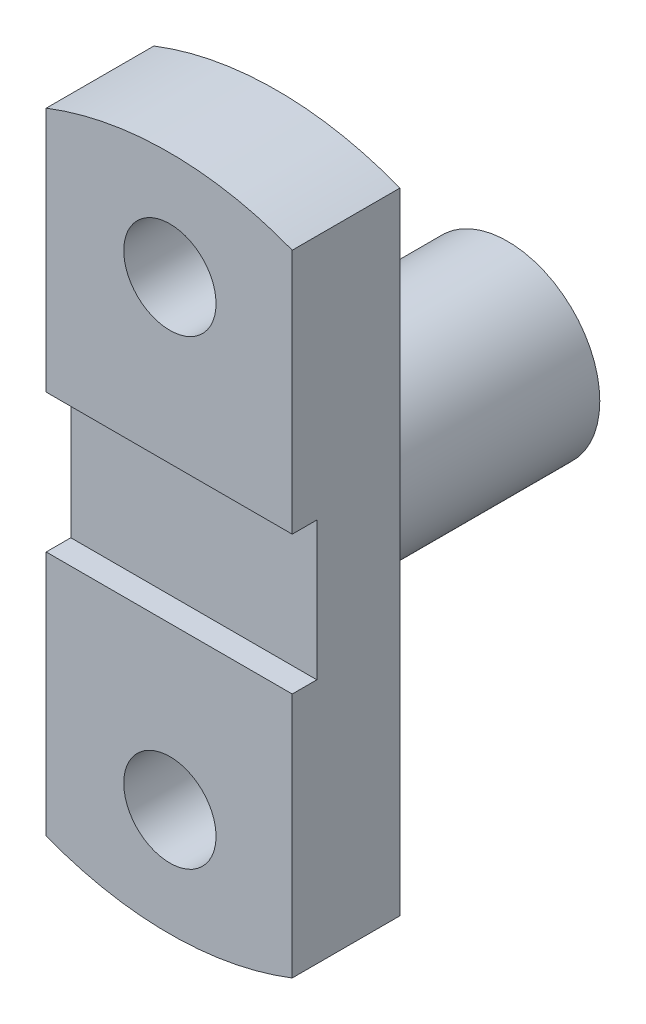
ISO-10303-21;
HEADER;
FILE_DESCRIPTION(('STEP AP214'),'2;1');
FILE_NAME('part.step','',(''),(''),'','','');
FILE_SCHEMA(('AUTOMOTIVE_DESIGN { 1 0 10303 214 1 1 1 1 }'));
ENDSEC;
DATA;
#1=APPLICATION_CONTEXT('core data for automotive mechanical design processes');
#2=APPLICATION_PROTOCOL_DEFINITION('international standard','automotive_design',2000,#1);
#3=PRODUCT_CONTEXT('',#1,'mechanical');
#4=PRODUCT('Part','Part','',(#3));
#5=PRODUCT_RELATED_PRODUCT_CATEGORY('part','',(#4));
#6=PRODUCT_DEFINITION_FORMATION('','',#4);
#7=PRODUCT_DEFINITION_CONTEXT('part definition',#1,'design');
#8=PRODUCT_DEFINITION('design','',#6,#7);
#9=PRODUCT_DEFINITION_SHAPE('','',#8);
#10=(LENGTH_UNIT() NAMED_UNIT(*) SI_UNIT(.MILLI.,.METRE.));
#11=(NAMED_UNIT(*) PLANE_ANGLE_UNIT() SI_UNIT($,.RADIAN.));
#12=(NAMED_UNIT(*) SI_UNIT($,.STERADIAN.) SOLID_ANGLE_UNIT());
#13=UNCERTAINTY_MEASURE_WITH_UNIT(LENGTH_MEASURE(1.E-05),#10,'distance_accuracy_value','');
#14=(GEOMETRIC_REPRESENTATION_CONTEXT(3) GLOBAL_UNCERTAINTY_ASSIGNED_CONTEXT((#13)) GLOBAL_UNIT_ASSIGNED_CONTEXT((#10,
#11,#12)) REPRESENTATION_CONTEXT('',''));
#15=CARTESIAN_POINT('',(0.,0.,0.));
#16=DIRECTION('',(0.,0.,1.));
#17=DIRECTION('',(1.,0.,0.));
#18=AXIS2_PLACEMENT_3D('',#15,#16,#17);
#19=CARTESIAN_POINT('',(0.,0.,35.));
#20=DIRECTION('',(0.,0.,1.));
#21=DIRECTION('',(1.,0.,0.));
#22=AXIS2_PLACEMENT_3D('',#19,#20,#21);
#23=PLANE('',#22);
#24=DIRECTION('',(1.,0.,0.));
#25=VECTOR('',#24,1.);
#26=CARTESIAN_POINT('',(-45.,22.5,35.));
#27=LINE('',#26,#25);
#28=CARTESIAN_POINT('',(-40.,22.5,35.));
#29=VERTEX_POINT('',#28);
#30=CARTESIAN_POINT('',(40.,22.5,35.));
#31=VERTEX_POINT('',#30);
#32=EDGE_CURVE('E153',#29,#31,#27,.T.);
#33=ORIENTED_EDGE('',*,*,#32,.T.);
#34=DIRECTION('',(0.,1.,0.));
#35=VECTOR('',#34,1.);
#36=CARTESIAN_POINT('',(40.,-102.469507659596,35.));
#37=LINE('',#36,#35);
#38=CARTESIAN_POINT('',(40.,102.469507659596,35.));
#39=VERTEX_POINT('',#38);
#40=EDGE_CURVE('E70',#31,#39,#37,.T.);
#41=ORIENTED_EDGE('',*,*,#40,.T.);
#42=CARTESIAN_POINT('',(0.,0.,35.));
#43=DIRECTION('',(0.,0.,1.));
#44=DIRECTION('',(1.,0.,0.));
#45=AXIS2_PLACEMENT_3D('',#42,#43,#44);
#46=CIRCLE('',#45,110.);
#47=CARTESIAN_POINT('',(-40.,102.469507659596,35.));
#48=VERTEX_POINT('',#47);
#49=EDGE_CURVE('E183',#39,#48,#46,.T.);
#50=ORIENTED_EDGE('',*,*,#49,.T.);
#51=DIRECTION('',(0.,-1.,0.));
#52=VECTOR('',#51,1.);
#53=CARTESIAN_POINT('',(-40.,-102.469507659596,35.));
#54=LINE('',#53,#52);
#55=EDGE_CURVE('E100',#48,#29,#54,.T.);
#56=ORIENTED_EDGE('',*,*,#55,.T.);
#57=EDGE_LOOP('',(#33,#41,#50,#56));
#58=FACE_BOUND('',#57,.T.);
#59=CARTESIAN_POINT('',(0.217775186598629,75.,35.));
#60=DIRECTION('',(0.,0.,1.));
#61=DIRECTION('',(1.,0.,0.));
#62=AXIS2_PLACEMENT_3D('',#59,#60,#61);
#63=CIRCLE('',#62,15.);
#64=CARTESIAN_POINT('',(15.2177751865986,75.,35.));
#65=VERTEX_POINT('',#64);
#66=EDGE_CURVE('E175',#65,#65,#63,.T.);
#67=ORIENTED_EDGE('',*,*,#66,.F.);
#68=EDGE_LOOP('',(#67));
#69=FACE_BOUND('',#68,.T.);
#70=ADVANCED_FACE('F45',(#58,#69),#23,.T.);
#71=DIRECTION('',(1.,0.,0.));
#72=VECTOR('',#71,1.);
#73=CARTESIAN_POINT('',(-45.,-22.5,35.));
#74=LINE('',#73,#72);
#75=CARTESIAN_POINT('',(-40.,-22.5,35.));
#76=VERTEX_POINT('',#75);
#77=CARTESIAN_POINT('',(40.,-22.5,35.));
#78=VERTEX_POINT('',#77);
#79=EDGE_CURVE('E61',#76,#78,#74,.T.);
#80=ORIENTED_EDGE('',*,*,#79,.F.);
#81=CARTESIAN_POINT('',(-40.,-102.469507659596,35.));
#82=VERTEX_POINT('',#81);
#83=EDGE_CURVE('E186',#76,#82,#54,.T.);
#84=ORIENTED_EDGE('',*,*,#83,.T.);
#85=CARTESIAN_POINT('',(0.,0.,35.));
#86=DIRECTION('',(0.,0.,1.));
#87=DIRECTION('',(1.,0.,0.));
#88=AXIS2_PLACEMENT_3D('',#85,#86,#87);
#89=CIRCLE('',#88,110.);
#90=CARTESIAN_POINT('',(40.,-102.469507659596,35.));
#91=VERTEX_POINT('',#90);
#92=EDGE_CURVE('E189',#82,#91,#89,.T.);
#93=ORIENTED_EDGE('',*,*,#92,.T.);
#94=EDGE_CURVE('E192',#91,#78,#37,.T.);
#95=ORIENTED_EDGE('',*,*,#94,.T.);
#96=EDGE_LOOP('',(#80,#84,#93,#95));
#97=FACE_BOUND('',#96,.T.);
#98=CARTESIAN_POINT('',(0.217775186598518,-75.,35.));
#99=DIRECTION('',(0.,0.,1.));
#100=DIRECTION('',(-1.,0.,0.));
#101=AXIS2_PLACEMENT_3D('',#98,#99,#100);
#102=CIRCLE('',#101,15.);
#103=CARTESIAN_POINT('',(-14.7822248134015,-75.,35.));
#104=VERTEX_POINT('',#103);
#105=EDGE_CURVE('E168',#104,#104,#102,.T.);
#106=ORIENTED_EDGE('',*,*,#105,.F.);
#107=EDGE_LOOP('',(#106));
#108=FACE_BOUND('',#107,.T.);
#109=ADVANCED_FACE('F231',(#97,#108),#23,.T.);
#110=CARTESIAN_POINT('',(0.,0.,0.));
#111=DIRECTION('',(0.,0.,1.));
#112=DIRECTION('',(1.,0.,0.));
#113=AXIS2_PLACEMENT_3D('',#110,#111,#112);
#114=PLANE('',#113);
#115=CARTESIAN_POINT('',(0.,0.,0.));
#116=DIRECTION('',(0.,0.,1.));
#117=DIRECTION('',(1.,0.,0.));
#118=AXIS2_PLACEMENT_3D('',#115,#116,#117);
#119=CIRCLE('',#118,30.);
#120=CARTESIAN_POINT('',(30.,0.,0.));
#121=VERTEX_POINT('',#120);
#122=EDGE_CURVE('E11',#121,#121,#119,.F.);
#123=ORIENTED_EDGE('',*,*,#122,.F.);
#124=EDGE_LOOP('',(#123));
#125=FACE_BOUND('',#124,.T.);
#126=CARTESIAN_POINT('',(0.,0.,0.));
#127=DIRECTION('',(0.,0.,1.));
#128=DIRECTION('',(1.,0.,0.));
#129=AXIS2_PLACEMENT_3D('',#126,#127,#128);
#130=CIRCLE('',#129,110.);
#131=CARTESIAN_POINT('',(40.,102.469507659596,0.));
#132=VERTEX_POINT('',#131);
#133=CARTESIAN_POINT('',(-40.,102.469507659596,0.));
#134=VERTEX_POINT('',#133);
#135=EDGE_CURVE('E179',#132,#134,#130,.T.);
#136=ORIENTED_EDGE('',*,*,#135,.F.);
#137=DIRECTION('',(0.,1.,0.));
#138=VECTOR('',#137,1.);
#139=CARTESIAN_POINT('',(40.,-102.469507659596,0.));
#140=LINE('',#139,#138);
#141=CARTESIAN_POINT('',(40.,-102.469507659596,0.));
#142=VERTEX_POINT('',#141);
#143=EDGE_CURVE('E92',#142,#132,#140,.T.);
#144=ORIENTED_EDGE('',*,*,#143,.F.);
#145=CARTESIAN_POINT('',(0.,0.,0.));
#146=DIRECTION('',(0.,0.,1.));
#147=DIRECTION('',(1.,0.,0.));
#148=AXIS2_PLACEMENT_3D('',#145,#146,#147);
#149=CIRCLE('',#148,110.);
#150=CARTESIAN_POINT('',(-40.,-102.469507659596,0.));
#151=VERTEX_POINT('',#150);
#152=EDGE_CURVE('E202',#151,#142,#149,.T.);
#153=ORIENTED_EDGE('',*,*,#152,.F.);
#154=DIRECTION('',(0.,-1.,0.));
#155=VECTOR('',#154,1.);
#156=CARTESIAN_POINT('',(-40.,-102.469507659596,0.));
#157=LINE('',#156,#155);
#158=EDGE_CURVE('E199',#134,#151,#157,.T.);
#159=ORIENTED_EDGE('',*,*,#158,.F.);
#160=EDGE_LOOP('',(#136,#144,#153,#159));
#161=FACE_BOUND('',#160,.T.);
#162=CARTESIAN_POINT('',(0.217775186598629,75.,0.));
#163=DIRECTION('',(0.,0.,1.));
#164=DIRECTION('',(1.,0.,0.));
#165=AXIS2_PLACEMENT_3D('',#162,#163,#164);
#166=CIRCLE('',#165,15.);
#167=CARTESIAN_POINT('',(15.2177751865986,75.,0.));
#168=VERTEX_POINT('',#167);
#169=EDGE_CURVE('E171',#168,#168,#166,.T.);
#170=ORIENTED_EDGE('',*,*,#169,.T.);
#171=EDGE_LOOP('',(#170));
#172=FACE_BOUND('',#171,.T.);
#173=CARTESIAN_POINT('',(0.217775186598518,-75.,0.));
#174=DIRECTION('',(0.,0.,1.));
#175=DIRECTION('',(-1.,0.,0.));
#176=AXIS2_PLACEMENT_3D('',#173,#174,#175);
#177=CIRCLE('',#176,15.);
#178=CARTESIAN_POINT('',(-14.7822248134015,-75.,0.));
#179=VERTEX_POINT('',#178);
#180=EDGE_CURVE('E167',#179,#179,#177,.T.);
#181=ORIENTED_EDGE('',*,*,#180,.T.);
#182=EDGE_LOOP('',(#181));
#183=FACE_BOUND('',#182,.T.);
#184=ADVANCED_FACE('F223',(#125,#161,#172,#183),#114,.F.);
#185=CARTESIAN_POINT('',(0.,0.,35.));
#186=DIRECTION('',(0.,0.,-1.));
#187=DIRECTION('',(-1.,0.,0.));
#188=AXIS2_PLACEMENT_3D('',#185,#186,#187);
#189=CYLINDRICAL_SURFACE('',#188,110.);
#190=ORIENTED_EDGE('',*,*,#135,.T.);
#191=DIRECTION('',(0.,0.,-1.));
#192=VECTOR('',#191,1.);
#193=CARTESIAN_POINT('',(-40.,102.469507659596,35.));
#194=LINE('',#193,#192);
#195=EDGE_CURVE('E54',#48,#134,#194,.T.);
#196=ORIENTED_EDGE('',*,*,#195,.F.);
#197=ORIENTED_EDGE('',*,*,#49,.F.);
#198=DIRECTION('',(0.,0.,-1.));
#199=VECTOR('',#198,1.);
#200=CARTESIAN_POINT('',(40.,102.469507659596,35.));
#201=LINE('',#200,#199);
#202=EDGE_CURVE('E195',#39,#132,#201,.T.);
#203=ORIENTED_EDGE('',*,*,#202,.T.);
#204=EDGE_LOOP('',(#190,#196,#197,#203));
#205=FACE_BOUND('',#204,.T.);
#206=ADVANCED_FACE('F47',(#205),#189,.T.);
#207=CARTESIAN_POINT('',(-40.,-102.469507659596,35.));
#208=DIRECTION('',(1.,0.,0.));
#209=DIRECTION('',(0.,0.,-1.));
#210=AXIS2_PLACEMENT_3D('',#207,#208,#209);
#211=PLANE('',#210);
#212=DIRECTION('',(0.,1.,0.));
#213=VECTOR('',#212,1.);
#214=CARTESIAN_POINT('',(-40.,-102.469507659596,27.));
#215=LINE('',#214,#213);
#216=CARTESIAN_POINT('',(-40.,-22.5,27.));
#217=VERTEX_POINT('',#216);
#218=CARTESIAN_POINT('',(-40.,22.5,27.));
#219=VERTEX_POINT('',#218);
#220=EDGE_CURVE('E131',#217,#219,#215,.T.);
#221=ORIENTED_EDGE('',*,*,#220,.T.);
#222=DIRECTION('',(0.,0.,1.));
#223=VECTOR('',#222,1.);
#224=CARTESIAN_POINT('',(-40.,22.5,35.));
#225=LINE('',#224,#223);
#226=EDGE_CURVE('E164',#219,#29,#225,.T.);
#227=ORIENTED_EDGE('',*,*,#226,.T.);
#228=ORIENTED_EDGE('',*,*,#55,.F.);
#229=ORIENTED_EDGE('',*,*,#195,.T.);
#230=ORIENTED_EDGE('',*,*,#158,.T.);
#231=DIRECTION('',(0.,0.,-1.));
#232=VECTOR('',#231,1.);
#233=CARTESIAN_POINT('',(-40.,-102.469507659596,35.));
#234=LINE('',#233,#232);
#235=EDGE_CURVE('E212',#82,#151,#234,.T.);
#236=ORIENTED_EDGE('',*,*,#235,.F.);
#237=ORIENTED_EDGE('',*,*,#83,.F.);
#238=DIRECTION('',(0.,0.,-1.));
#239=VECTOR('',#238,1.);
#240=CARTESIAN_POINT('',(-40.,-22.5,35.));
#241=LINE('',#240,#239);
#242=EDGE_CURVE('E156',#76,#217,#241,.T.);
#243=ORIENTED_EDGE('',*,*,#242,.T.);
#244=EDGE_LOOP('',(#221,#227,#228,#229,#230,#236,#237,#243));
#245=FACE_BOUND('',#244,.T.);
#246=ADVANCED_FACE('F217',(#245),#211,.F.);
#247=CARTESIAN_POINT('',(0.,0.,35.));
#248=DIRECTION('',(0.,0.,-1.));
#249=DIRECTION('',(-1.,0.,0.));
#250=AXIS2_PLACEMENT_3D('',#247,#248,#249);
#251=CYLINDRICAL_SURFACE('',#250,110.);
#252=ORIENTED_EDGE('',*,*,#152,.T.);
#253=DIRECTION('',(0.,0.,-1.));
#254=VECTOR('',#253,1.);
#255=CARTESIAN_POINT('',(40.,-102.469507659596,35.));
#256=LINE('',#255,#254);
#257=EDGE_CURVE('E209',#91,#142,#256,.T.);
#258=ORIENTED_EDGE('',*,*,#257,.F.);
#259=ORIENTED_EDGE('',*,*,#92,.F.);
#260=ORIENTED_EDGE('',*,*,#235,.T.);
#261=EDGE_LOOP('',(#252,#258,#259,#260));
#262=FACE_BOUND('',#261,.T.);
#263=ADVANCED_FACE('F228',(#262),#251,.T.);
#264=CARTESIAN_POINT('',(40.,-102.469507659596,35.));
#265=DIRECTION('',(-1.,0.,0.));
#266=DIRECTION('',(0.,0.,1.));
#267=AXIS2_PLACEMENT_3D('',#264,#265,#266);
#268=PLANE('',#267);
#269=ORIENTED_EDGE('',*,*,#40,.F.);
#270=DIRECTION('',(0.,0.,1.));
#271=VECTOR('',#270,1.);
#272=CARTESIAN_POINT('',(40.,22.5,35.));
#273=LINE('',#272,#271);
#274=CARTESIAN_POINT('',(40.,22.5,27.));
#275=VERTEX_POINT('',#274);
#276=EDGE_CURVE('E144',#275,#31,#273,.T.);
#277=ORIENTED_EDGE('',*,*,#276,.F.);
#278=DIRECTION('',(0.,1.,0.));
#279=VECTOR('',#278,1.);
#280=CARTESIAN_POINT('',(40.,22.5,27.));
#281=LINE('',#280,#279);
#282=CARTESIAN_POINT('',(40.,-22.5,27.));
#283=VERTEX_POINT('',#282);
#284=EDGE_CURVE('E128',#283,#275,#281,.T.);
#285=ORIENTED_EDGE('',*,*,#284,.F.);
#286=DIRECTION('',(0.,0.,-1.));
#287=VECTOR('',#286,1.);
#288=CARTESIAN_POINT('',(40.,-22.5,27.));
#289=LINE('',#288,#287);
#290=EDGE_CURVE('E136',#78,#283,#289,.T.);
#291=ORIENTED_EDGE('',*,*,#290,.F.);
#292=ORIENTED_EDGE('',*,*,#94,.F.);
#293=ORIENTED_EDGE('',*,*,#257,.T.);
#294=ORIENTED_EDGE('',*,*,#143,.T.);
#295=ORIENTED_EDGE('',*,*,#202,.F.);
#296=EDGE_LOOP('',(#269,#277,#285,#291,#292,#293,#294,#295));
#297=FACE_BOUND('',#296,.T.);
#298=ADVANCED_FACE('F143',(#297),#268,.F.);
#299=CARTESIAN_POINT('',(0.217775186598629,75.,35.));
#300=DIRECTION('',(0.,0.,-1.));
#301=DIRECTION('',(-1.,0.,0.));
#302=AXIS2_PLACEMENT_3D('',#299,#300,#301);
#303=CYLINDRICAL_SURFACE('',#302,15.);
#304=ORIENTED_EDGE('',*,*,#66,.T.);
#305=EDGE_LOOP('',(#304));
#306=FACE_BOUND('',#305,.T.);
#307=ORIENTED_EDGE('',*,*,#169,.F.);
#308=EDGE_LOOP('',(#307));
#309=FACE_BOUND('',#308,.T.);
#310=ADVANCED_FACE('F259',(#306,#309),#303,.F.);
#311=CARTESIAN_POINT('',(0.217775186598518,-75.,35.));
#312=DIRECTION('',(0.,0.,-1.));
#313=DIRECTION('',(-1.,0.,0.));
#314=AXIS2_PLACEMENT_3D('',#311,#312,#313);
#315=CYLINDRICAL_SURFACE('',#314,15.);
#316=ORIENTED_EDGE('',*,*,#105,.T.);
#317=EDGE_LOOP('',(#316));
#318=FACE_BOUND('',#317,.T.);
#319=ORIENTED_EDGE('',*,*,#180,.F.);
#320=EDGE_LOOP('',(#319));
#321=FACE_BOUND('',#320,.T.);
#322=ADVANCED_FACE('F262',(#318,#321),#315,.F.);
#323=CARTESIAN_POINT('',(-45.,22.5,35.));
#324=DIRECTION('',(0.,1.,0.));
#325=DIRECTION('',(0.,0.,1.));
#326=AXIS2_PLACEMENT_3D('',#323,#324,#325);
#327=PLANE('',#326);
#328=DIRECTION('',(1.,0.,0.));
#329=VECTOR('',#328,1.);
#330=CARTESIAN_POINT('',(-45.,22.5,27.));
#331=LINE('',#330,#329);
#332=EDGE_CURVE('E134',#219,#275,#331,.T.);
#333=ORIENTED_EDGE('',*,*,#332,.T.);
#334=ORIENTED_EDGE('',*,*,#276,.T.);
#335=ORIENTED_EDGE('',*,*,#32,.F.);
#336=ORIENTED_EDGE('',*,*,#226,.F.);
#337=EDGE_LOOP('',(#333,#334,#335,#336));
#338=FACE_BOUND('',#337,.T.);
#339=ADVANCED_FACE('F266',(#338),#327,.F.);
#340=CARTESIAN_POINT('',(-45.,22.5,27.));
#341=DIRECTION('',(0.,0.,-1.));
#342=DIRECTION('',(-1.,0.,0.));
#343=AXIS2_PLACEMENT_3D('',#340,#341,#342);
#344=PLANE('',#343);
#345=DIRECTION('',(1.,0.,0.));
#346=VECTOR('',#345,1.);
#347=CARTESIAN_POINT('',(-45.,-22.5,27.));
#348=LINE('',#347,#346);
#349=EDGE_CURVE('E124',#217,#283,#348,.T.);
#350=ORIENTED_EDGE('',*,*,#349,.T.);
#351=ORIENTED_EDGE('',*,*,#284,.T.);
#352=ORIENTED_EDGE('',*,*,#332,.F.);
#353=ORIENTED_EDGE('',*,*,#220,.F.);
#354=EDGE_LOOP('',(#350,#351,#352,#353));
#355=FACE_BOUND('',#354,.T.);
#356=ADVANCED_FACE('F125',(#355),#344,.F.);
#357=CARTESIAN_POINT('',(-45.,-22.5,27.));
#358=DIRECTION('',(0.,-1.,0.));
#359=DIRECTION('',(0.,0.,-1.));
#360=AXIS2_PLACEMENT_3D('',#357,#358,#359);
#361=PLANE('',#360);
#362=ORIENTED_EDGE('',*,*,#79,.T.);
#363=ORIENTED_EDGE('',*,*,#290,.T.);
#364=ORIENTED_EDGE('',*,*,#349,.F.);
#365=ORIENTED_EDGE('',*,*,#242,.F.);
#366=EDGE_LOOP('',(#362,#363,#364,#365));
#367=FACE_BOUND('',#366,.T.);
#368=ADVANCED_FACE('F137',(#367),#361,.F.);
#369=CARTESIAN_POINT('',(0.,0.,-75.));
#370=DIRECTION('',(0.,0.,1.));
#371=DIRECTION('',(1.,0.,0.));
#372=AXIS2_PLACEMENT_3D('',#369,#370,#371);
#373=CYLINDRICAL_SURFACE('',#372,30.);
#374=CARTESIAN_POINT('',(0.,0.,-75.));
#375=DIRECTION('',(0.,0.,-1.));
#376=DIRECTION('',(-1.,0.,0.));
#377=AXIS2_PLACEMENT_3D('',#374,#375,#376);
#378=CIRCLE('',#377,30.);
#379=CARTESIAN_POINT('',(-30.,0.,-75.));
#380=VERTEX_POINT('',#379);
#381=EDGE_CURVE('E141',#380,#380,#378,.T.);
#382=ORIENTED_EDGE('',*,*,#381,.F.);
#383=EDGE_LOOP('',(#382));
#384=FACE_BOUND('',#383,.T.);
#385=ORIENTED_EDGE('',*,*,#122,.T.);
#386=EDGE_LOOP('',(#385));
#387=FACE_BOUND('',#386,.T.);
#388=ADVANCED_FACE('F242',(#384,#387),#373,.T.);
#389=CARTESIAN_POINT('',(0.,0.,-75.));
#390=DIRECTION('',(0.,0.,-1.));
#391=DIRECTION('',(-1.,0.,0.));
#392=AXIS2_PLACEMENT_3D('',#389,#390,#391);
#393=PLANE('',#392);
#394=ORIENTED_EDGE('',*,*,#381,.T.);
#395=EDGE_LOOP('',(#394));
#396=FACE_BOUND('',#395,.T.);
#397=ADVANCED_FACE('F240',(#396),#393,.T.);
#398=CLOSED_SHELL('',(#70,#109,#184,#206,#246,#263,#298,#310,#322,#339,#356,#368,#388,#397));
#399=MANIFOLD_SOLID_BREP('B2',#398);
#400=ADVANCED_BREP_SHAPE_REPRESENTATION('',(#18,#399),#14);
#401=SHAPE_DEFINITION_REPRESENTATION(#9,#400);
ENDSEC;
END-ISO-10303-21;
